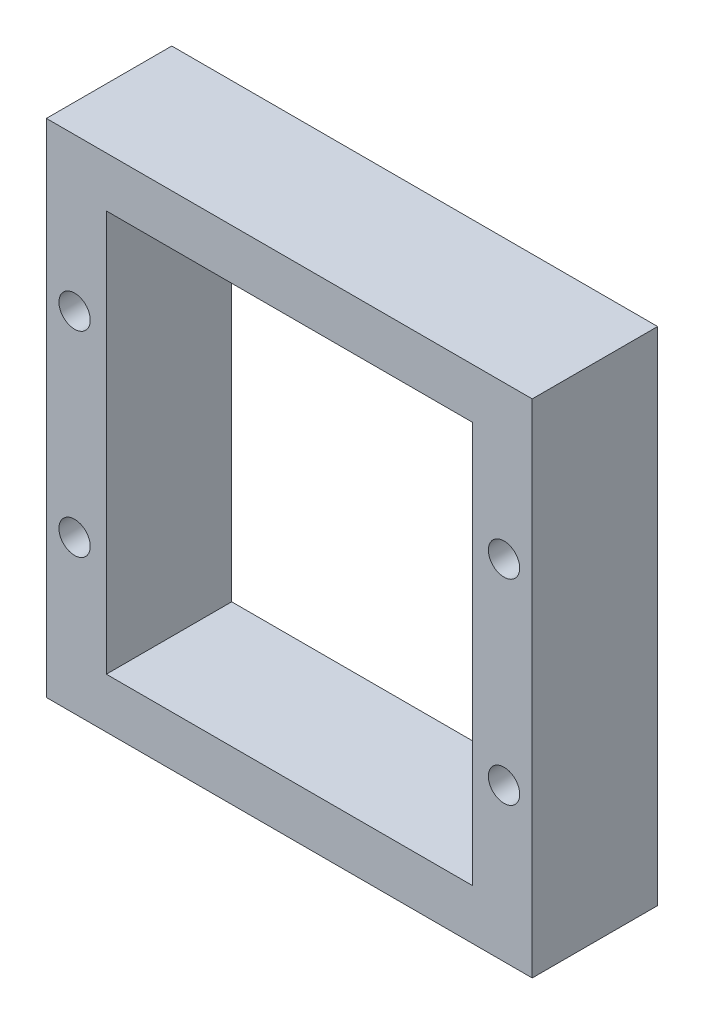
ISO-10303-21;
HEADER;
FILE_DESCRIPTION(('STEP AP214'),'2;1');
FILE_NAME('part.step','',(''),(''),'','','');
FILE_SCHEMA(('AUTOMOTIVE_DESIGN { 1 0 10303 214 1 1 1 1 }'));
ENDSEC;
DATA;
#1=APPLICATION_CONTEXT('core data for automotive mechanical design processes');
#2=APPLICATION_PROTOCOL_DEFINITION('international standard','automotive_design',2000,#1);
#3=PRODUCT_CONTEXT('',#1,'mechanical');
#4=PRODUCT('Part','Part','',(#3));
#5=PRODUCT_RELATED_PRODUCT_CATEGORY('part','',(#4));
#6=PRODUCT_DEFINITION_FORMATION('','',#4);
#7=PRODUCT_DEFINITION_CONTEXT('part definition',#1,'design');
#8=PRODUCT_DEFINITION('design','',#6,#7);
#9=PRODUCT_DEFINITION_SHAPE('','',#8);
#10=(LENGTH_UNIT() NAMED_UNIT(*) SI_UNIT(.MILLI.,.METRE.));
#11=(NAMED_UNIT(*) PLANE_ANGLE_UNIT() SI_UNIT($,.RADIAN.));
#12=(NAMED_UNIT(*) SI_UNIT($,.STERADIAN.) SOLID_ANGLE_UNIT());
#13=UNCERTAINTY_MEASURE_WITH_UNIT(LENGTH_MEASURE(1.E-05),#10,'distance_accuracy_value','');
#14=(GEOMETRIC_REPRESENTATION_CONTEXT(3) GLOBAL_UNCERTAINTY_ASSIGNED_CONTEXT((#13)) GLOBAL_UNIT_ASSIGNED_CONTEXT((#10,
#11,#12)) REPRESENTATION_CONTEXT('',''));
#15=CARTESIAN_POINT('',(0.,0.,0.));
#16=DIRECTION('',(0.,0.,1.));
#17=DIRECTION('',(1.,0.,0.));
#18=AXIS2_PLACEMENT_3D('',#15,#16,#17);
#19=CARTESIAN_POINT('',(15.5,-16.,8.));
#20=DIRECTION('',(-1.,0.,0.));
#21=DIRECTION('',(0.,0.,1.));
#22=AXIS2_PLACEMENT_3D('',#19,#20,#21);
#23=PLANE('',#22);
#24=DIRECTION('',(0.,1.,0.));
#25=VECTOR('',#24,1.);
#26=CARTESIAN_POINT('',(15.5,-16.,0.));
#27=LINE('',#26,#25);
#28=CARTESIAN_POINT('',(15.5,-16.,0.));
#29=VERTEX_POINT('',#28);
#30=CARTESIAN_POINT('',(15.5,16.,0.));
#31=VERTEX_POINT('',#30);
#32=EDGE_CURVE('E128',#29,#31,#27,.T.);
#33=ORIENTED_EDGE('',*,*,#32,.T.);
#34=DIRECTION('',(0.,0.,-1.));
#35=VECTOR('',#34,1.);
#36=CARTESIAN_POINT('',(15.5,16.,8.));
#37=LINE('',#36,#35);
#38=CARTESIAN_POINT('',(15.5,16.,8.));
#39=VERTEX_POINT('',#38);
#40=EDGE_CURVE('E157',#39,#31,#37,.T.);
#41=ORIENTED_EDGE('',*,*,#40,.F.);
#42=DIRECTION('',(0.,1.,0.));
#43=VECTOR('',#42,1.);
#44=CARTESIAN_POINT('',(15.5,-16.,8.));
#45=LINE('',#44,#43);
#46=CARTESIAN_POINT('',(15.5,-16.,8.));
#47=VERTEX_POINT('',#46);
#48=EDGE_CURVE('E131',#47,#39,#45,.T.);
#49=ORIENTED_EDGE('',*,*,#48,.F.);
#50=DIRECTION('',(0.,0.,-1.));
#51=VECTOR('',#50,1.);
#52=CARTESIAN_POINT('',(15.5,-16.,8.));
#53=LINE('',#52,#51);
#54=EDGE_CURVE('E141',#47,#29,#53,.T.);
#55=ORIENTED_EDGE('',*,*,#54,.T.);
#56=EDGE_LOOP('',(#33,#41,#49,#55));
#57=FACE_BOUND('',#56,.T.);
#58=ADVANCED_FACE('F37',(#57),#23,.F.);
#59=CARTESIAN_POINT('',(-15.5,16.,8.));
#60=DIRECTION('',(0.,-1.,0.));
#61=DIRECTION('',(0.,0.,-1.));
#62=AXIS2_PLACEMENT_3D('',#59,#60,#61);
#63=PLANE('',#62);
#64=DIRECTION('',(-1.,0.,0.));
#65=VECTOR('',#64,1.);
#66=CARTESIAN_POINT('',(-15.5,16.,0.));
#67=LINE('',#66,#65);
#68=CARTESIAN_POINT('',(-15.5,16.,0.));
#69=VERTEX_POINT('',#68);
#70=EDGE_CURVE('E144',#31,#69,#67,.T.);
#71=ORIENTED_EDGE('',*,*,#70,.T.);
#72=DIRECTION('',(0.,0.,-1.));
#73=VECTOR('',#72,1.);
#74=CARTESIAN_POINT('',(-15.5,16.,8.));
#75=LINE('',#74,#73);
#76=CARTESIAN_POINT('',(-15.5,16.,8.));
#77=VERTEX_POINT('',#76);
#78=EDGE_CURVE('E154',#77,#69,#75,.T.);
#79=ORIENTED_EDGE('',*,*,#78,.F.);
#80=DIRECTION('',(-1.,0.,0.));
#81=VECTOR('',#80,1.);
#82=CARTESIAN_POINT('',(-15.5,16.,8.));
#83=LINE('',#82,#81);
#84=EDGE_CURVE('E134',#39,#77,#83,.T.);
#85=ORIENTED_EDGE('',*,*,#84,.F.);
#86=ORIENTED_EDGE('',*,*,#40,.T.);
#87=EDGE_LOOP('',(#71,#79,#85,#86));
#88=FACE_BOUND('',#87,.T.);
#89=ADVANCED_FACE('F215',(#88),#63,.F.);
#90=CARTESIAN_POINT('',(-15.5,-16.,8.));
#91=DIRECTION('',(1.,0.,0.));
#92=DIRECTION('',(0.,0.,-1.));
#93=AXIS2_PLACEMENT_3D('',#90,#91,#92);
#94=PLANE('',#93);
#95=DIRECTION('',(0.,-1.,0.));
#96=VECTOR('',#95,1.);
#97=CARTESIAN_POINT('',(-15.5,-16.,0.));
#98=LINE('',#97,#96);
#99=CARTESIAN_POINT('',(-15.5,-16.,0.));
#100=VERTEX_POINT('',#99);
#101=EDGE_CURVE('E146',#69,#100,#98,.T.);
#102=ORIENTED_EDGE('',*,*,#101,.T.);
#103=DIRECTION('',(0.,0.,-1.));
#104=VECTOR('',#103,1.);
#105=CARTESIAN_POINT('',(-15.5,-16.,8.));
#106=LINE('',#105,#104);
#107=CARTESIAN_POINT('',(-15.5,-16.,8.));
#108=VERTEX_POINT('',#107);
#109=EDGE_CURVE('E151',#108,#100,#106,.T.);
#110=ORIENTED_EDGE('',*,*,#109,.F.);
#111=DIRECTION('',(0.,-1.,0.));
#112=VECTOR('',#111,1.);
#113=CARTESIAN_POINT('',(-15.5,-16.,8.));
#114=LINE('',#113,#112);
#115=EDGE_CURVE('E137',#77,#108,#114,.T.);
#116=ORIENTED_EDGE('',*,*,#115,.F.);
#117=ORIENTED_EDGE('',*,*,#78,.T.);
#118=EDGE_LOOP('',(#102,#110,#116,#117));
#119=FACE_BOUND('',#118,.T.);
#120=ADVANCED_FACE('F220',(#119),#94,.F.);
#121=CARTESIAN_POINT('',(-15.5,-16.,8.));
#122=DIRECTION('',(0.,1.,0.));
#123=DIRECTION('',(0.,0.,1.));
#124=AXIS2_PLACEMENT_3D('',#121,#122,#123);
#125=PLANE('',#124);
#126=DIRECTION('',(1.,0.,0.));
#127=VECTOR('',#126,1.);
#128=CARTESIAN_POINT('',(-15.5,-16.,0.));
#129=LINE('',#128,#127);
#130=EDGE_CURVE('E135',#100,#29,#129,.T.);
#131=ORIENTED_EDGE('',*,*,#130,.T.);
#132=ORIENTED_EDGE('',*,*,#54,.F.);
#133=DIRECTION('',(1.,0.,0.));
#134=VECTOR('',#133,1.);
#135=CARTESIAN_POINT('',(-15.5,-16.,8.));
#136=LINE('',#135,#134);
#137=EDGE_CURVE('E139',#108,#47,#136,.T.);
#138=ORIENTED_EDGE('',*,*,#137,.F.);
#139=ORIENTED_EDGE('',*,*,#109,.T.);
#140=EDGE_LOOP('',(#131,#132,#138,#139));
#141=FACE_BOUND('',#140,.T.);
#142=ADVANCED_FACE('F195',(#141),#125,.F.);
#143=CARTESIAN_POINT('',(0.,0.,8.));
#144=DIRECTION('',(0.,0.,-1.));
#145=DIRECTION('',(-1.,0.,0.));
#146=AXIS2_PLACEMENT_3D('',#143,#144,#145);
#147=PLANE('',#146);
#148=CARTESIAN_POINT('',(-13.7,6.25,8.));
#149=DIRECTION('',(0.,0.,1.));
#150=DIRECTION('',(-1.,0.,0.));
#151=AXIS2_PLACEMENT_3D('',#148,#149,#150);
#152=CIRCLE('',#151,1.);
#153=CARTESIAN_POINT('',(-14.7,6.25,8.));
#154=VERTEX_POINT('',#153);
#155=EDGE_CURVE('E181',#154,#154,#152,.T.);
#156=ORIENTED_EDGE('',*,*,#155,.F.);
#157=EDGE_LOOP('',(#156));
#158=FACE_BOUND('',#157,.T.);
#159=CARTESIAN_POINT('',(-13.7,-6.25,8.));
#160=DIRECTION('',(0.,0.,1.));
#161=DIRECTION('',(-1.,0.,0.));
#162=AXIS2_PLACEMENT_3D('',#159,#160,#161);
#163=CIRCLE('',#162,1.00000000000001);
#164=CARTESIAN_POINT('',(-14.7,-6.25,8.));
#165=VERTEX_POINT('',#164);
#166=EDGE_CURVE('E184',#165,#165,#163,.T.);
#167=ORIENTED_EDGE('',*,*,#166,.F.);
#168=EDGE_LOOP('',(#167));
#169=FACE_BOUND('',#168,.T.);
#170=CARTESIAN_POINT('',(13.7,-6.25,8.));
#171=DIRECTION('',(0.,0.,1.));
#172=DIRECTION('',(1.,0.,0.));
#173=AXIS2_PLACEMENT_3D('',#170,#171,#172);
#174=CIRCLE('',#173,1.00000000000001);
#175=CARTESIAN_POINT('',(14.7,-6.25,8.));
#176=VERTEX_POINT('',#175);
#177=EDGE_CURVE('E180',#176,#176,#174,.T.);
#178=ORIENTED_EDGE('',*,*,#177,.F.);
#179=EDGE_LOOP('',(#178));
#180=FACE_BOUND('',#179,.T.);
#181=CARTESIAN_POINT('',(13.7,6.25,8.));
#182=DIRECTION('',(0.,0.,1.));
#183=DIRECTION('',(1.,0.,0.));
#184=AXIS2_PLACEMENT_3D('',#181,#182,#183);
#185=CIRCLE('',#184,1.);
#186=CARTESIAN_POINT('',(14.7,6.25,8.));
#187=VERTEX_POINT('',#186);
#188=EDGE_CURVE('E168',#187,#187,#185,.T.);
#189=ORIENTED_EDGE('',*,*,#188,.F.);
#190=EDGE_LOOP('',(#189));
#191=FACE_BOUND('',#190,.T.);
#192=DIRECTION('',(-1.,0.,0.));
#193=VECTOR('',#192,1.);
#194=CARTESIAN_POINT('',(-11.675,12.8,8.));
#195=LINE('',#194,#193);
#196=CARTESIAN_POINT('',(11.675,12.8,8.));
#197=VERTEX_POINT('',#196);
#198=CARTESIAN_POINT('',(-11.675,12.8,8.));
#199=VERTEX_POINT('',#198);
#200=EDGE_CURVE('E114',#197,#199,#195,.T.);
#201=ORIENTED_EDGE('',*,*,#200,.F.);
#202=DIRECTION('',(0.,1.,0.));
#203=VECTOR('',#202,1.);
#204=CARTESIAN_POINT('',(11.675,-12.8,8.));
#205=LINE('',#204,#203);
#206=CARTESIAN_POINT('',(11.675,-12.8,8.));
#207=VERTEX_POINT('',#206);
#208=EDGE_CURVE('E53',#207,#197,#205,.T.);
#209=ORIENTED_EDGE('',*,*,#208,.F.);
#210=DIRECTION('',(1.,0.,0.));
#211=VECTOR('',#210,1.);
#212=CARTESIAN_POINT('',(-11.675,-12.8,8.));
#213=LINE('',#212,#211);
#214=CARTESIAN_POINT('',(-11.675,-12.8,8.));
#215=VERTEX_POINT('',#214);
#216=EDGE_CURVE('E121',#215,#207,#213,.T.);
#217=ORIENTED_EDGE('',*,*,#216,.F.);
#218=DIRECTION('',(0.,-1.,0.));
#219=VECTOR('',#218,1.);
#220=CARTESIAN_POINT('',(-11.675,-12.8,8.));
#221=LINE('',#220,#219);
#222=EDGE_CURVE('E105',#199,#215,#221,.T.);
#223=ORIENTED_EDGE('',*,*,#222,.F.);
#224=EDGE_LOOP('',(#201,#209,#217,#223));
#225=FACE_BOUND('',#224,.T.);
#226=ORIENTED_EDGE('',*,*,#48,.T.);
#227=ORIENTED_EDGE('',*,*,#84,.T.);
#228=ORIENTED_EDGE('',*,*,#115,.T.);
#229=ORIENTED_EDGE('',*,*,#137,.T.);
#230=EDGE_LOOP('',(#226,#227,#228,#229));
#231=FACE_BOUND('',#230,.T.);
#232=ADVANCED_FACE('F118',(#158,#169,#180,#191,#225,#231),#147,.F.);
#233=CARTESIAN_POINT('',(0.,0.,0.));
#234=DIRECTION('',(0.,0.,-1.));
#235=DIRECTION('',(-1.,0.,0.));
#236=AXIS2_PLACEMENT_3D('',#233,#234,#235);
#237=PLANE('',#236);
#238=CARTESIAN_POINT('',(-13.7,6.25,0.));
#239=DIRECTION('',(0.,0.,-1.));
#240=DIRECTION('',(-1.,0.,0.));
#241=AXIS2_PLACEMENT_3D('',#238,#239,#240);
#242=CIRCLE('',#241,1.);
#243=CARTESIAN_POINT('',(-14.7,6.25,0.));
#244=VERTEX_POINT('',#243);
#245=EDGE_CURVE('E40',#244,#244,#242,.T.);
#246=ORIENTED_EDGE('',*,*,#245,.F.);
#247=EDGE_LOOP('',(#246));
#248=FACE_BOUND('',#247,.T.);
#249=CARTESIAN_POINT('',(-13.7,-6.25,0.));
#250=DIRECTION('',(0.,0.,-1.));
#251=DIRECTION('',(-1.,0.,0.));
#252=AXIS2_PLACEMENT_3D('',#249,#250,#251);
#253=CIRCLE('',#252,1.00000000000001);
#254=CARTESIAN_POINT('',(-14.7,-6.25,0.));
#255=VERTEX_POINT('',#254);
#256=EDGE_CURVE('E170',#255,#255,#253,.T.);
#257=ORIENTED_EDGE('',*,*,#256,.F.);
#258=EDGE_LOOP('',(#257));
#259=FACE_BOUND('',#258,.T.);
#260=CARTESIAN_POINT('',(13.7,-6.25,0.));
#261=DIRECTION('',(0.,0.,-1.));
#262=DIRECTION('',(-1.,0.,0.));
#263=AXIS2_PLACEMENT_3D('',#260,#261,#262);
#264=CIRCLE('',#263,1.00000000000001);
#265=CARTESIAN_POINT('',(12.7,-6.25,0.));
#266=VERTEX_POINT('',#265);
#267=EDGE_CURVE('E167',#266,#266,#264,.T.);
#268=ORIENTED_EDGE('',*,*,#267,.F.);
#269=EDGE_LOOP('',(#268));
#270=FACE_BOUND('',#269,.T.);
#271=CARTESIAN_POINT('',(13.7,6.25,0.));
#272=DIRECTION('',(0.,0.,-1.));
#273=DIRECTION('',(-1.,0.,0.));
#274=AXIS2_PLACEMENT_3D('',#271,#272,#273);
#275=CIRCLE('',#274,1.);
#276=CARTESIAN_POINT('',(12.7,6.25,0.));
#277=VERTEX_POINT('',#276);
#278=EDGE_CURVE('E164',#277,#277,#275,.T.);
#279=ORIENTED_EDGE('',*,*,#278,.F.);
#280=EDGE_LOOP('',(#279));
#281=FACE_BOUND('',#280,.T.);
#282=DIRECTION('',(0.,-1.,0.));
#283=VECTOR('',#282,1.);
#284=CARTESIAN_POINT('',(11.675,0.,0.));
#285=LINE('',#284,#283);
#286=CARTESIAN_POINT('',(11.675,12.8,0.));
#287=VERTEX_POINT('',#286);
#288=CARTESIAN_POINT('',(11.675,-12.8,0.));
#289=VERTEX_POINT('',#288);
#290=EDGE_CURVE('E11',#287,#289,#285,.T.);
#291=ORIENTED_EDGE('',*,*,#290,.F.);
#292=DIRECTION('',(1.,0.,0.));
#293=VECTOR('',#292,1.);
#294=CARTESIAN_POINT('',(0.,12.8,0.));
#295=LINE('',#294,#293);
#296=CARTESIAN_POINT('',(-11.675,12.8,0.));
#297=VERTEX_POINT('',#296);
#298=EDGE_CURVE('E160',#297,#287,#295,.T.);
#299=ORIENTED_EDGE('',*,*,#298,.F.);
#300=DIRECTION('',(0.,1.,0.));
#301=VECTOR('',#300,1.);
#302=CARTESIAN_POINT('',(-11.675,0.,0.));
#303=LINE('',#302,#301);
#304=CARTESIAN_POINT('',(-11.675,-12.8,0.));
#305=VERTEX_POINT('',#304);
#306=EDGE_CURVE('E108',#305,#297,#303,.T.);
#307=ORIENTED_EDGE('',*,*,#306,.F.);
#308=DIRECTION('',(-1.,0.,0.));
#309=VECTOR('',#308,1.);
#310=CARTESIAN_POINT('',(0.,-12.8,0.));
#311=LINE('',#310,#309);
#312=EDGE_CURVE('E45',#289,#305,#311,.T.);
#313=ORIENTED_EDGE('',*,*,#312,.F.);
#314=EDGE_LOOP('',(#291,#299,#307,#313));
#315=FACE_BOUND('',#314,.T.);
#316=ORIENTED_EDGE('',*,*,#32,.F.);
#317=ORIENTED_EDGE('',*,*,#130,.F.);
#318=ORIENTED_EDGE('',*,*,#101,.F.);
#319=ORIENTED_EDGE('',*,*,#70,.F.);
#320=EDGE_LOOP('',(#316,#317,#318,#319));
#321=FACE_BOUND('',#320,.T.);
#322=ADVANCED_FACE('F194',(#248,#259,#270,#281,#315,#321),#237,.T.);
#323=CARTESIAN_POINT('',(11.675,-12.8,-5.));
#324=DIRECTION('',(1.,0.,0.));
#325=DIRECTION('',(0.,0.,-1.));
#326=AXIS2_PLACEMENT_3D('',#323,#324,#325);
#327=PLANE('',#326);
#328=ORIENTED_EDGE('',*,*,#290,.T.);
#329=DIRECTION('',(0.,0.,1.));
#330=VECTOR('',#329,1.);
#331=CARTESIAN_POINT('',(11.675,-12.8,-5.));
#332=LINE('',#331,#330);
#333=EDGE_CURVE('E126',#289,#207,#332,.T.);
#334=ORIENTED_EDGE('',*,*,#333,.T.);
#335=ORIENTED_EDGE('',*,*,#208,.T.);
#336=DIRECTION('',(0.,0.,1.));
#337=VECTOR('',#336,1.);
#338=CARTESIAN_POINT('',(11.675,12.8,-5.));
#339=LINE('',#338,#337);
#340=EDGE_CURVE('E111',#287,#197,#339,.T.);
#341=ORIENTED_EDGE('',*,*,#340,.F.);
#342=EDGE_LOOP('',(#328,#334,#335,#341));
#343=FACE_BOUND('',#342,.T.);
#344=ADVANCED_FACE('F243',(#343),#327,.F.);
#345=CARTESIAN_POINT('',(-11.675,-12.8,-5.));
#346=DIRECTION('',(0.,-1.,0.));
#347=DIRECTION('',(0.,0.,-1.));
#348=AXIS2_PLACEMENT_3D('',#345,#346,#347);
#349=PLANE('',#348);
#350=ORIENTED_EDGE('',*,*,#312,.T.);
#351=DIRECTION('',(0.,0.,1.));
#352=VECTOR('',#351,1.);
#353=CARTESIAN_POINT('',(-11.675,-12.8,-5.));
#354=LINE('',#353,#352);
#355=EDGE_CURVE('E110',#305,#215,#354,.T.);
#356=ORIENTED_EDGE('',*,*,#355,.T.);
#357=ORIENTED_EDGE('',*,*,#216,.T.);
#358=ORIENTED_EDGE('',*,*,#333,.F.);
#359=EDGE_LOOP('',(#350,#356,#357,#358));
#360=FACE_BOUND('',#359,.T.);
#361=ADVANCED_FACE('F247',(#360),#349,.F.);
#362=CARTESIAN_POINT('',(-11.675,-12.8,-5.));
#363=DIRECTION('',(-1.,0.,0.));
#364=DIRECTION('',(0.,0.,1.));
#365=AXIS2_PLACEMENT_3D('',#362,#363,#364);
#366=PLANE('',#365);
#367=ORIENTED_EDGE('',*,*,#306,.T.);
#368=DIRECTION('',(0.,0.,1.));
#369=VECTOR('',#368,1.);
#370=CARTESIAN_POINT('',(-11.675,12.8,-5.));
#371=LINE('',#370,#369);
#372=EDGE_CURVE('E61',#297,#199,#371,.T.);
#373=ORIENTED_EDGE('',*,*,#372,.T.);
#374=ORIENTED_EDGE('',*,*,#222,.T.);
#375=ORIENTED_EDGE('',*,*,#355,.F.);
#376=EDGE_LOOP('',(#367,#373,#374,#375));
#377=FACE_BOUND('',#376,.T.);
#378=ADVANCED_FACE('F102',(#377),#366,.F.);
#379=CARTESIAN_POINT('',(-11.675,12.8,-5.));
#380=DIRECTION('',(0.,1.,0.));
#381=DIRECTION('',(0.,0.,1.));
#382=AXIS2_PLACEMENT_3D('',#379,#380,#381);
#383=PLANE('',#382);
#384=ORIENTED_EDGE('',*,*,#298,.T.);
#385=ORIENTED_EDGE('',*,*,#340,.T.);
#386=ORIENTED_EDGE('',*,*,#200,.T.);
#387=ORIENTED_EDGE('',*,*,#372,.F.);
#388=EDGE_LOOP('',(#384,#385,#386,#387));
#389=FACE_BOUND('',#388,.T.);
#390=ADVANCED_FACE('F115',(#389),#383,.F.);
#391=CARTESIAN_POINT('',(13.7,6.25,-2.));
#392=DIRECTION('',(0.,0.,1.));
#393=DIRECTION('',(1.,0.,0.));
#394=AXIS2_PLACEMENT_3D('',#391,#392,#393);
#395=CYLINDRICAL_SURFACE('',#394,1.);
#396=ORIENTED_EDGE('',*,*,#278,.T.);
#397=EDGE_LOOP('',(#396));
#398=FACE_BOUND('',#397,.T.);
#399=ORIENTED_EDGE('',*,*,#188,.T.);
#400=EDGE_LOOP('',(#399));
#401=FACE_BOUND('',#400,.T.);
#402=ADVANCED_FACE('F200',(#398,#401),#395,.F.);
#403=CARTESIAN_POINT('',(13.7,-6.25,-2.));
#404=DIRECTION('',(0.,0.,1.));
#405=DIRECTION('',(1.,0.,0.));
#406=AXIS2_PLACEMENT_3D('',#403,#404,#405);
#407=CYLINDRICAL_SURFACE('',#406,1.00000000000001);
#408=ORIENTED_EDGE('',*,*,#267,.T.);
#409=EDGE_LOOP('',(#408));
#410=FACE_BOUND('',#409,.T.);
#411=ORIENTED_EDGE('',*,*,#177,.T.);
#412=EDGE_LOOP('',(#411));
#413=FACE_BOUND('',#412,.T.);
#414=ADVANCED_FACE('F190',(#410,#413),#407,.F.);
#415=CARTESIAN_POINT('',(-13.7,-6.25,-2.));
#416=DIRECTION('',(0.,0.,1.));
#417=DIRECTION('',(1.,0.,0.));
#418=AXIS2_PLACEMENT_3D('',#415,#416,#417);
#419=CYLINDRICAL_SURFACE('',#418,1.00000000000001);
#420=ORIENTED_EDGE('',*,*,#256,.T.);
#421=EDGE_LOOP('',(#420));
#422=FACE_BOUND('',#421,.T.);
#423=ORIENTED_EDGE('',*,*,#166,.T.);
#424=EDGE_LOOP('',(#423));
#425=FACE_BOUND('',#424,.T.);
#426=ADVANCED_FACE('F208',(#422,#425),#419,.F.);
#427=CARTESIAN_POINT('',(-13.7,6.25,-2.));
#428=DIRECTION('',(0.,0.,1.));
#429=DIRECTION('',(1.,0.,0.));
#430=AXIS2_PLACEMENT_3D('',#427,#428,#429);
#431=CYLINDRICAL_SURFACE('',#430,1.);
#432=ORIENTED_EDGE('',*,*,#245,.T.);
#433=EDGE_LOOP('',(#432));
#434=FACE_BOUND('',#433,.T.);
#435=ORIENTED_EDGE('',*,*,#155,.T.);
#436=EDGE_LOOP('',(#435));
#437=FACE_BOUND('',#436,.T.);
#438=ADVANCED_FACE('F306',(#434,#437),#431,.F.);
#439=CLOSED_SHELL('',(#58,#89,#120,#142,#232,#322,#344,#361,#378,#390,#402,#414,#426,#438));
#440=MANIFOLD_SOLID_BREP('B2',#439);
#441=ADVANCED_BREP_SHAPE_REPRESENTATION('',(#18,#440),#14);
#442=SHAPE_DEFINITION_REPRESENTATION(#9,#441);
ENDSEC;
END-ISO-10303-21;
